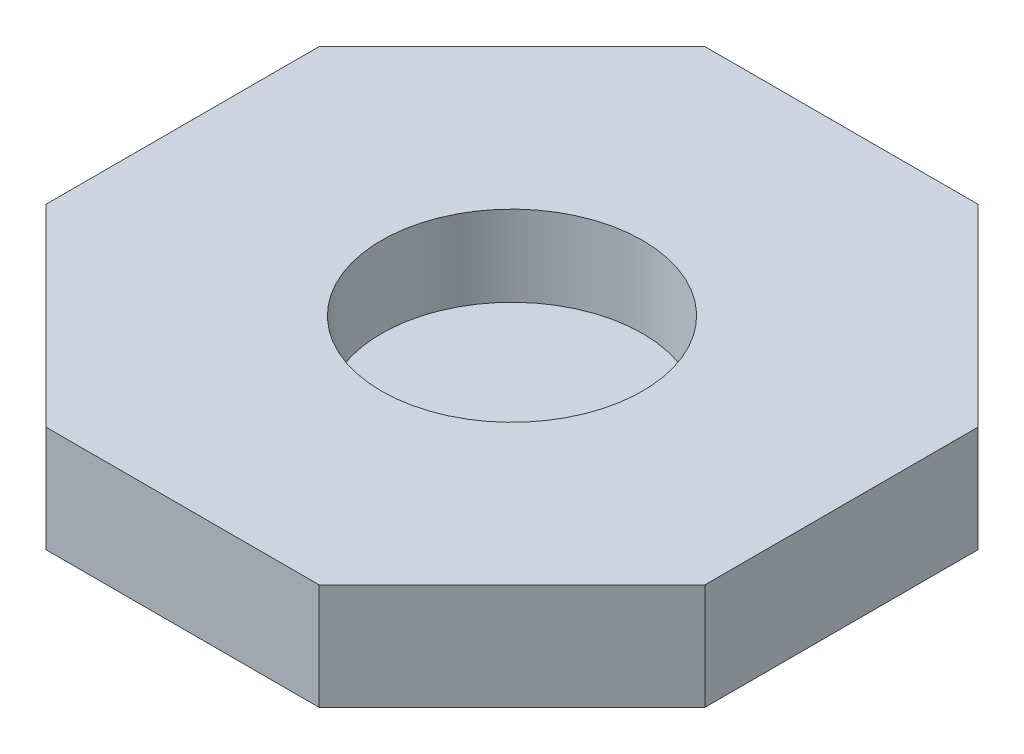
ISO-10303-21;
HEADER;
FILE_DESCRIPTION(('STEP AP214'),'2;1');
FILE_NAME('part.step','',(''),(''),'','','');
FILE_SCHEMA(('AUTOMOTIVE_DESIGN { 1 0 10303 214 1 1 1 1 }'));
ENDSEC;
DATA;
#1=APPLICATION_CONTEXT('core data for automotive mechanical design processes');
#2=APPLICATION_PROTOCOL_DEFINITION('international standard','automotive_design',2000,#1);
#3=PRODUCT_CONTEXT('',#1,'mechanical');
#4=PRODUCT('Part','Part','',(#3));
#5=PRODUCT_RELATED_PRODUCT_CATEGORY('part','',(#4));
#6=PRODUCT_DEFINITION_FORMATION('','',#4);
#7=PRODUCT_DEFINITION_CONTEXT('part definition',#1,'design');
#8=PRODUCT_DEFINITION('design','',#6,#7);
#9=PRODUCT_DEFINITION_SHAPE('','',#8);
#10=(LENGTH_UNIT() NAMED_UNIT(*) SI_UNIT(.MILLI.,.METRE.));
#11=(NAMED_UNIT(*) PLANE_ANGLE_UNIT() SI_UNIT($,.RADIAN.));
#12=(NAMED_UNIT(*) SI_UNIT($,.STERADIAN.) SOLID_ANGLE_UNIT());
#13=UNCERTAINTY_MEASURE_WITH_UNIT(LENGTH_MEASURE(1.E-05),#10,'distance_accuracy_value','');
#14=(GEOMETRIC_REPRESENTATION_CONTEXT(3) GLOBAL_UNCERTAINTY_ASSIGNED_CONTEXT((#13)) GLOBAL_UNIT_ASSIGNED_CONTEXT((#10,
#11,#12)) REPRESENTATION_CONTEXT('',''));
#15=CARTESIAN_POINT('',(0.,0.,0.));
#16=DIRECTION('',(0.,0.,1.));
#17=DIRECTION('',(1.,0.,0.));
#18=AXIS2_PLACEMENT_3D('',#15,#16,#17);
#19=CARTESIAN_POINT('',(0.,0.,0.));
#20=DIRECTION('',(0.,1.,0.));
#21=DIRECTION('',(0.,0.,1.));
#22=AXIS2_PLACEMENT_3D('',#19,#20,#21);
#23=PLANE('',#22);
#24=DIRECTION('',(1.,0.,0.));
#25=VECTOR('',#24,1.);
#26=CARTESIAN_POINT('',(-5.43453692681118,0.,-13.1201327539249));
#27=LINE('',#26,#25);
#28=CARTESIAN_POINT('',(-5.43453692681118,0.,-13.1201327539249));
#29=VERTEX_POINT('',#28);
#30=CARTESIAN_POINT('',(5.4345369268112,0.,-13.1201327539249));
#31=VERTEX_POINT('',#30);
#32=EDGE_CURVE('E251',#29,#31,#27,.T.);
#33=ORIENTED_EDGE('',*,*,#32,.T.);
#34=DIRECTION('',(0.707106781186548,0.,0.707106781186547));
#35=VECTOR('',#34,1.);
#36=CARTESIAN_POINT('',(5.4345369268112,0.,-13.1201327539249));
#37=LINE('',#36,#35);
#38=CARTESIAN_POINT('',(13.120132753925,0.,-5.43453692681118));
#39=VERTEX_POINT('',#38);
#40=EDGE_CURVE('E207',#31,#39,#37,.T.);
#41=ORIENTED_EDGE('',*,*,#40,.T.);
#42=DIRECTION('',(0.,0.,1.));
#43=VECTOR('',#42,1.);
#44=CARTESIAN_POINT('',(13.120132753925,0.,-5.43453692681118));
#45=LINE('',#44,#43);
#46=CARTESIAN_POINT('',(13.120132753925,0.,5.43453692681119));
#47=VERTEX_POINT('',#46);
#48=EDGE_CURVE('E63',#39,#47,#45,.T.);
#49=ORIENTED_EDGE('',*,*,#48,.T.);
#50=DIRECTION('',(-0.707106781186548,0.,0.707106781186547));
#51=VECTOR('',#50,1.);
#52=CARTESIAN_POINT('',(13.120132753925,0.,5.43453692681119));
#53=LINE('',#52,#51);
#54=CARTESIAN_POINT('',(5.43453692681119,0.,13.120132753925));
#55=VERTEX_POINT('',#54);
#56=EDGE_CURVE('E256',#47,#55,#53,.T.);
#57=ORIENTED_EDGE('',*,*,#56,.T.);
#58=DIRECTION('',(-1.,0.,0.));
#59=VECTOR('',#58,1.);
#60=CARTESIAN_POINT('',(5.43453692681119,0.,13.120132753925));
#61=LINE('',#60,#59);
#62=CARTESIAN_POINT('',(-5.43453692681118,0.,13.120132753925));
#63=VERTEX_POINT('',#62);
#64=EDGE_CURVE('E259',#55,#63,#61,.T.);
#65=ORIENTED_EDGE('',*,*,#64,.T.);
#66=DIRECTION('',(-0.707106781186548,0.,-0.707106781186547));
#67=VECTOR('',#66,1.);
#68=CARTESIAN_POINT('',(-5.43453692681118,0.,13.120132753925));
#69=LINE('',#68,#67);
#70=CARTESIAN_POINT('',(-13.1201327539249,0.,5.4345369268112));
#71=VERTEX_POINT('',#70);
#72=EDGE_CURVE('E262',#63,#71,#69,.T.);
#73=ORIENTED_EDGE('',*,*,#72,.T.);
#74=DIRECTION('',(0.,0.,-1.));
#75=VECTOR('',#74,1.);
#76=CARTESIAN_POINT('',(-13.1201327539249,0.,5.4345369268112));
#77=LINE('',#76,#75);
#78=CARTESIAN_POINT('',(-13.1201327539249,0.,-5.43453692681117));
#79=VERTEX_POINT('',#78);
#80=EDGE_CURVE('E231',#71,#79,#77,.T.);
#81=ORIENTED_EDGE('',*,*,#80,.T.);
#82=DIRECTION('',(0.707106781186547,0.,-0.707106781186548));
#83=VECTOR('',#82,1.);
#84=CARTESIAN_POINT('',(-13.1201327539249,0.,-5.43453692681117));
#85=LINE('',#84,#83);
#86=EDGE_CURVE('E228',#79,#29,#85,.T.);
#87=ORIENTED_EDGE('',*,*,#86,.T.);
#88=EDGE_LOOP('',(#33,#41,#49,#57,#65,#73,#81,#87));
#89=FACE_BOUND('',#88,.T.);
#90=CARTESIAN_POINT('',(0.,0.,0.));
#91=DIRECTION('',(0.,1.,0.));
#92=DIRECTION('',(0.,0.,1.));
#93=AXIS2_PLACEMENT_3D('',#90,#91,#92);
#94=CIRCLE('',#93,5.);
#95=CARTESIAN_POINT('',(0.,0.,5.));
#96=VERTEX_POINT('',#95);
#97=EDGE_CURVE('E11',#96,#96,#94,.F.);
#98=ORIENTED_EDGE('',*,*,#97,.F.);
#99=EDGE_LOOP('',(#98));
#100=FACE_BOUND('',#99,.T.);
#101=ADVANCED_FACE('F40',(#89,#100),#23,.F.);
#102=CARTESIAN_POINT('',(10.9743911152158,5.,-10.9743911152158));
#103=DIRECTION('',(-0.707106781186548,0.,0.707106781186548));
#104=DIRECTION('',(0.707106781186548,0.,0.707106781186548));
#105=AXIS2_PLACEMENT_3D('',#102,#103,#104);
#106=PLANE('',#105);
#107=DIRECTION('',(-0.707106781186548,0.,-0.707106781186548));
#108=VECTOR('',#107,1.);
#109=CARTESIAN_POINT('',(10.9743911152158,0.,-10.9743911152158));
#110=LINE('',#109,#108);
#111=CARTESIAN_POINT('',(15.520132753925,0.,-6.42864947650661));
#112=VERTEX_POINT('',#111);
#113=CARTESIAN_POINT('',(6.42864947650663,0.,-15.5201327539249));
#114=VERTEX_POINT('',#113);
#115=EDGE_CURVE('E328',#112,#114,#110,.T.);
#116=ORIENTED_EDGE('',*,*,#115,.T.);
#117=DIRECTION('',(0.,-1.,0.));
#118=VECTOR('',#117,1.);
#119=CARTESIAN_POINT('',(6.42864947650663,5.,-15.5201327539249));
#120=LINE('',#119,#118);
#121=CARTESIAN_POINT('',(6.42864947650663,5.,-15.5201327539249));
#122=VERTEX_POINT('',#121);
#123=EDGE_CURVE('E48',#122,#114,#120,.T.);
#124=ORIENTED_EDGE('',*,*,#123,.F.);
#125=DIRECTION('',(-0.707106781186548,0.,-0.707106781186548));
#126=VECTOR('',#125,1.);
#127=CARTESIAN_POINT('',(10.9743911152158,5.,-10.9743911152158));
#128=LINE('',#127,#126);
#129=CARTESIAN_POINT('',(15.520132753925,5.,-6.42864947650661));
#130=VERTEX_POINT('',#129);
#131=EDGE_CURVE('E342',#130,#122,#128,.T.);
#132=ORIENTED_EDGE('',*,*,#131,.F.);
#133=DIRECTION('',(0.,-1.,0.));
#134=VECTOR('',#133,1.);
#135=CARTESIAN_POINT('',(15.520132753925,5.,-6.42864947650661));
#136=LINE('',#135,#134);
#137=EDGE_CURVE('E360',#130,#112,#136,.T.);
#138=ORIENTED_EDGE('',*,*,#137,.T.);
#139=EDGE_LOOP('',(#116,#124,#132,#138));
#140=FACE_BOUND('',#139,.T.);
#141=ADVANCED_FACE('F42',(#140),#106,.F.);
#142=CARTESIAN_POINT('',(0.,5.,-15.5201327539249));
#143=DIRECTION('',(0.,0.,1.));
#144=DIRECTION('',(1.,0.,0.));
#145=AXIS2_PLACEMENT_3D('',#142,#143,#144);
#146=PLANE('',#145);
#147=DIRECTION('',(-1.,0.,0.));
#148=VECTOR('',#147,1.);
#149=CARTESIAN_POINT('',(0.,0.,-15.5201327539249));
#150=LINE('',#149,#148);
#151=CARTESIAN_POINT('',(-6.42864947650661,0.,-15.5201327539249));
#152=VERTEX_POINT('',#151);
#153=EDGE_CURVE('E363',#114,#152,#150,.T.);
#154=ORIENTED_EDGE('',*,*,#153,.T.);
#155=DIRECTION('',(0.,-1.,0.));
#156=VECTOR('',#155,1.);
#157=CARTESIAN_POINT('',(-6.42864947650661,5.,-15.5201327539249));
#158=LINE('',#157,#156);
#159=CARTESIAN_POINT('',(-6.42864947650661,5.,-15.5201327539249));
#160=VERTEX_POINT('',#159);
#161=EDGE_CURVE('E393',#160,#152,#158,.T.);
#162=ORIENTED_EDGE('',*,*,#161,.F.);
#163=DIRECTION('',(-1.,0.,0.));
#164=VECTOR('',#163,1.);
#165=CARTESIAN_POINT('',(0.,5.,-15.5201327539249));
#166=LINE('',#165,#164);
#167=EDGE_CURVE('E345',#122,#160,#166,.T.);
#168=ORIENTED_EDGE('',*,*,#167,.F.);
#169=ORIENTED_EDGE('',*,*,#123,.T.);
#170=EDGE_LOOP('',(#154,#162,#168,#169));
#171=FACE_BOUND('',#170,.T.);
#172=ADVANCED_FACE('F398',(#171),#146,.F.);
#173=CARTESIAN_POINT('',(-10.9743911152158,5.,-10.9743911152158));
#174=DIRECTION('',(0.707106781186548,0.,0.707106781186547));
#175=DIRECTION('',(0.707106781186547,0.,-0.707106781186548));
#176=AXIS2_PLACEMENT_3D('',#173,#174,#175);
#177=PLANE('',#176);
#178=DIRECTION('',(-0.707106781186547,0.,0.707106781186548));
#179=VECTOR('',#178,1.);
#180=CARTESIAN_POINT('',(-10.9743911152158,0.,-10.9743911152158));
#181=LINE('',#180,#179);
#182=CARTESIAN_POINT('',(-15.5201327539249,0.,-6.4286494765066));
#183=VERTEX_POINT('',#182);
#184=EDGE_CURVE('E365',#152,#183,#181,.T.);
#185=ORIENTED_EDGE('',*,*,#184,.T.);
#186=DIRECTION('',(0.,-1.,0.));
#187=VECTOR('',#186,1.);
#188=CARTESIAN_POINT('',(-15.5201327539249,5.,-6.4286494765066));
#189=LINE('',#188,#187);
#190=CARTESIAN_POINT('',(-15.5201327539249,5.,-6.4286494765066));
#191=VERTEX_POINT('',#190);
#192=EDGE_CURVE('E390',#191,#183,#189,.T.);
#193=ORIENTED_EDGE('',*,*,#192,.F.);
#194=DIRECTION('',(-0.707106781186547,0.,0.707106781186548));
#195=VECTOR('',#194,1.);
#196=CARTESIAN_POINT('',(-10.9743911152158,5.,-10.9743911152158));
#197=LINE('',#196,#195);
#198=EDGE_CURVE('E348',#160,#191,#197,.T.);
#199=ORIENTED_EDGE('',*,*,#198,.F.);
#200=ORIENTED_EDGE('',*,*,#161,.T.);
#201=EDGE_LOOP('',(#185,#193,#199,#200));
#202=FACE_BOUND('',#201,.T.);
#203=ADVANCED_FACE('F413',(#202),#177,.F.);
#204=CARTESIAN_POINT('',(-15.5201327539249,5.,0.));
#205=DIRECTION('',(1.,0.,0.));
#206=DIRECTION('',(0.,0.,-1.));
#207=AXIS2_PLACEMENT_3D('',#204,#205,#206);
#208=PLANE('',#207);
#209=DIRECTION('',(0.,0.,1.));
#210=VECTOR('',#209,1.);
#211=CARTESIAN_POINT('',(-15.5201327539249,0.,0.));
#212=LINE('',#211,#210);
#213=CARTESIAN_POINT('',(-15.5201327539249,0.,6.42864947650662));
#214=VERTEX_POINT('',#213);
#215=EDGE_CURVE('E367',#183,#214,#212,.T.);
#216=ORIENTED_EDGE('',*,*,#215,.T.);
#217=DIRECTION('',(0.,-1.,0.));
#218=VECTOR('',#217,1.);
#219=CARTESIAN_POINT('',(-15.5201327539249,5.,6.42864947650662));
#220=LINE('',#219,#218);
#221=CARTESIAN_POINT('',(-15.5201327539249,5.,6.42864947650662));
#222=VERTEX_POINT('',#221);
#223=EDGE_CURVE('E387',#222,#214,#220,.T.);
#224=ORIENTED_EDGE('',*,*,#223,.F.);
#225=DIRECTION('',(0.,0.,1.));
#226=VECTOR('',#225,1.);
#227=CARTESIAN_POINT('',(-15.5201327539249,5.,0.));
#228=LINE('',#227,#226);
#229=EDGE_CURVE('E350',#191,#222,#228,.T.);
#230=ORIENTED_EDGE('',*,*,#229,.F.);
#231=ORIENTED_EDGE('',*,*,#192,.T.);
#232=EDGE_LOOP('',(#216,#224,#230,#231));
#233=FACE_BOUND('',#232,.T.);
#234=ADVANCED_FACE('F417',(#233),#208,.F.);
#235=CARTESIAN_POINT('',(-10.9743911152158,5.,10.9743911152158));
#236=DIRECTION('',(0.707106781186548,0.,-0.707106781186548));
#237=DIRECTION('',(-0.707106781186548,0.,-0.707106781186548));
#238=AXIS2_PLACEMENT_3D('',#235,#236,#237);
#239=PLANE('',#238);
#240=DIRECTION('',(0.707106781186548,0.,0.707106781186548));
#241=VECTOR('',#240,1.);
#242=CARTESIAN_POINT('',(-10.9743911152158,0.,10.9743911152158));
#243=LINE('',#242,#241);
#244=CARTESIAN_POINT('',(-6.42864947650661,0.,15.520132753925));
#245=VERTEX_POINT('',#244);
#246=EDGE_CURVE('E369',#214,#245,#243,.T.);
#247=ORIENTED_EDGE('',*,*,#246,.T.);
#248=DIRECTION('',(0.,-1.,0.));
#249=VECTOR('',#248,1.);
#250=CARTESIAN_POINT('',(-6.42864947650661,5.,15.520132753925));
#251=LINE('',#250,#249);
#252=CARTESIAN_POINT('',(-6.42864947650661,5.,15.520132753925));
#253=VERTEX_POINT('',#252);
#254=EDGE_CURVE('E384',#253,#245,#251,.T.);
#255=ORIENTED_EDGE('',*,*,#254,.F.);
#256=DIRECTION('',(0.707106781186548,0.,0.707106781186548));
#257=VECTOR('',#256,1.);
#258=CARTESIAN_POINT('',(-10.9743911152158,5.,10.9743911152158));
#259=LINE('',#258,#257);
#260=EDGE_CURVE('E352',#222,#253,#259,.T.);
#261=ORIENTED_EDGE('',*,*,#260,.F.);
#262=ORIENTED_EDGE('',*,*,#223,.T.);
#263=EDGE_LOOP('',(#247,#255,#261,#262));
#264=FACE_BOUND('',#263,.T.);
#265=ADVANCED_FACE('F436',(#264),#239,.F.);
#266=CARTESIAN_POINT('',(0.,5.,15.520132753925));
#267=DIRECTION('',(0.,0.,-1.));
#268=DIRECTION('',(-1.,0.,0.));
#269=AXIS2_PLACEMENT_3D('',#266,#267,#268);
#270=PLANE('',#269);
#271=DIRECTION('',(1.,0.,0.));
#272=VECTOR('',#271,1.);
#273=CARTESIAN_POINT('',(0.,0.,15.520132753925));
#274=LINE('',#273,#272);
#275=CARTESIAN_POINT('',(6.42864947650662,0.,15.520132753925));
#276=VERTEX_POINT('',#275);
#277=EDGE_CURVE('E371',#245,#276,#274,.T.);
#278=ORIENTED_EDGE('',*,*,#277,.T.);
#279=DIRECTION('',(0.,-1.,0.));
#280=VECTOR('',#279,1.);
#281=CARTESIAN_POINT('',(6.42864947650662,5.,15.520132753925));
#282=LINE('',#281,#280);
#283=CARTESIAN_POINT('',(6.42864947650662,5.,15.520132753925));
#284=VERTEX_POINT('',#283);
#285=EDGE_CURVE('E381',#284,#276,#282,.T.);
#286=ORIENTED_EDGE('',*,*,#285,.F.);
#287=DIRECTION('',(1.,0.,0.));
#288=VECTOR('',#287,1.);
#289=CARTESIAN_POINT('',(0.,5.,15.520132753925));
#290=LINE('',#289,#288);
#291=EDGE_CURVE('E354',#253,#284,#290,.T.);
#292=ORIENTED_EDGE('',*,*,#291,.F.);
#293=ORIENTED_EDGE('',*,*,#254,.T.);
#294=EDGE_LOOP('',(#278,#286,#292,#293));
#295=FACE_BOUND('',#294,.T.);
#296=ADVANCED_FACE('F433',(#295),#270,.F.);
#297=CARTESIAN_POINT('',(10.9743911152158,5.,10.9743911152158));
#298=DIRECTION('',(-0.707106781186547,0.,-0.707106781186548));
#299=DIRECTION('',(-0.707106781186548,0.,0.707106781186547));
#300=AXIS2_PLACEMENT_3D('',#297,#298,#299);
#301=PLANE('',#300);
#302=DIRECTION('',(0.707106781186548,0.,-0.707106781186547));
#303=VECTOR('',#302,1.);
#304=CARTESIAN_POINT('',(10.9743911152158,0.,10.9743911152158));
#305=LINE('',#304,#303);
#306=CARTESIAN_POINT('',(15.520132753925,0.,6.42864947650662));
#307=VERTEX_POINT('',#306);
#308=EDGE_CURVE('E373',#276,#307,#305,.T.);
#309=ORIENTED_EDGE('',*,*,#308,.T.);
#310=DIRECTION('',(0.,-1.,0.));
#311=VECTOR('',#310,1.);
#312=CARTESIAN_POINT('',(15.520132753925,5.,6.42864947650662));
#313=LINE('',#312,#311);
#314=CARTESIAN_POINT('',(15.520132753925,5.,6.42864947650662));
#315=VERTEX_POINT('',#314);
#316=EDGE_CURVE('E378',#315,#307,#313,.T.);
#317=ORIENTED_EDGE('',*,*,#316,.F.);
#318=DIRECTION('',(0.707106781186548,0.,-0.707106781186547));
#319=VECTOR('',#318,1.);
#320=CARTESIAN_POINT('',(10.9743911152158,5.,10.9743911152158));
#321=LINE('',#320,#319);
#322=EDGE_CURVE('E356',#284,#315,#321,.T.);
#323=ORIENTED_EDGE('',*,*,#322,.F.);
#324=ORIENTED_EDGE('',*,*,#285,.T.);
#325=EDGE_LOOP('',(#309,#317,#323,#324));
#326=FACE_BOUND('',#325,.T.);
#327=ADVANCED_FACE('F429',(#326),#301,.F.);
#328=CARTESIAN_POINT('',(15.520132753925,5.,0.));
#329=DIRECTION('',(-1.,0.,0.));
#330=DIRECTION('',(0.,0.,1.));
#331=AXIS2_PLACEMENT_3D('',#328,#329,#330);
#332=PLANE('',#331);
#333=DIRECTION('',(0.,0.,-1.));
#334=VECTOR('',#333,1.);
#335=CARTESIAN_POINT('',(15.520132753925,0.,0.));
#336=LINE('',#335,#334);
#337=EDGE_CURVE('E346',#307,#112,#336,.T.);
#338=ORIENTED_EDGE('',*,*,#337,.T.);
#339=ORIENTED_EDGE('',*,*,#137,.F.);
#340=DIRECTION('',(0.,0.,-1.));
#341=VECTOR('',#340,1.);
#342=CARTESIAN_POINT('',(15.520132753925,5.,0.));
#343=LINE('',#342,#341);
#344=EDGE_CURVE('E358',#315,#130,#343,.T.);
#345=ORIENTED_EDGE('',*,*,#344,.F.);
#346=ORIENTED_EDGE('',*,*,#316,.T.);
#347=EDGE_LOOP('',(#338,#339,#345,#346));
#348=FACE_BOUND('',#347,.T.);
#349=ADVANCED_FACE('F427',(#348),#332,.F.);
#350=CARTESIAN_POINT('',(0.,5.,0.));
#351=DIRECTION('',(0.,1.,0.));
#352=DIRECTION('',(0.,0.,1.));
#353=AXIS2_PLACEMENT_3D('',#350,#351,#352);
#354=PLANE('',#353);
#355=CARTESIAN_POINT('',(0.,5.,0.));
#356=DIRECTION('',(0.,1.,0.));
#357=DIRECTION('',(0.,0.,1.));
#358=AXIS2_PLACEMENT_3D('',#355,#356,#357);
#359=CIRCLE('',#358,6.15);
#360=CARTESIAN_POINT('',(0.,5.,6.15));
#361=VERTEX_POINT('',#360);
#362=EDGE_CURVE('E234',#361,#361,#359,.T.);
#363=ORIENTED_EDGE('',*,*,#362,.F.);
#364=EDGE_LOOP('',(#363));
#365=FACE_BOUND('',#364,.T.);
#366=ORIENTED_EDGE('',*,*,#131,.T.);
#367=ORIENTED_EDGE('',*,*,#167,.T.);
#368=ORIENTED_EDGE('',*,*,#198,.T.);
#369=ORIENTED_EDGE('',*,*,#229,.T.);
#370=ORIENTED_EDGE('',*,*,#260,.T.);
#371=ORIENTED_EDGE('',*,*,#291,.T.);
#372=ORIENTED_EDGE('',*,*,#322,.T.);
#373=ORIENTED_EDGE('',*,*,#344,.T.);
#374=EDGE_LOOP('',(#366,#367,#368,#369,#370,#371,#372,#373));
#375=FACE_BOUND('',#374,.T.);
#376=ADVANCED_FACE('F421',(#365,#375),#354,.T.);
#377=DIRECTION('',(0.707106781186547,0.,0.707106781186547));
#378=VECTOR('',#377,1.);
#379=CARTESIAN_POINT('',(5.93159320165891,0.,-14.3201327539249));
#380=LINE('',#379,#378);
#381=CARTESIAN_POINT('',(5.93159320165891,0.,-14.3201327539249));
#382=VERTEX_POINT('',#381);
#383=CARTESIAN_POINT('',(14.320132753925,0.,-5.9315932016589));
#384=VERTEX_POINT('',#383);
#385=EDGE_CURVE('E306',#382,#384,#380,.T.);
#386=ORIENTED_EDGE('',*,*,#385,.F.);
#387=DIRECTION('',(1.,0.,0.));
#388=VECTOR('',#387,1.);
#389=CARTESIAN_POINT('',(-5.93159320165889,0.,-14.3201327539249));
#390=LINE('',#389,#388);
#391=CARTESIAN_POINT('',(-5.93159320165889,0.,-14.3201327539249));
#392=VERTEX_POINT('',#391);
#393=EDGE_CURVE('E55',#392,#382,#390,.T.);
#394=ORIENTED_EDGE('',*,*,#393,.F.);
#395=DIRECTION('',(0.707106781186547,0.,-0.707106781186547));
#396=VECTOR('',#395,1.);
#397=CARTESIAN_POINT('',(-14.3201327539249,0.,-5.93159320165888));
#398=LINE('',#397,#396);
#399=CARTESIAN_POINT('',(-14.3201327539249,0.,-5.93159320165888));
#400=VERTEX_POINT('',#399);
#401=EDGE_CURVE('E283',#400,#392,#398,.T.);
#402=ORIENTED_EDGE('',*,*,#401,.F.);
#403=DIRECTION('',(0.,0.,-1.));
#404=VECTOR('',#403,1.);
#405=CARTESIAN_POINT('',(-14.3201327539249,0.,5.93159320165891));
#406=LINE('',#405,#404);
#407=CARTESIAN_POINT('',(-14.3201327539249,0.,5.93159320165891));
#408=VERTEX_POINT('',#407);
#409=EDGE_CURVE('E321',#408,#400,#406,.T.);
#410=ORIENTED_EDGE('',*,*,#409,.F.);
#411=DIRECTION('',(-0.707106781186548,0.,-0.707106781186548));
#412=VECTOR('',#411,1.);
#413=CARTESIAN_POINT('',(-5.9315932016589,0.,14.320132753925));
#414=LINE('',#413,#412);
#415=CARTESIAN_POINT('',(-5.9315932016589,0.,14.320132753925));
#416=VERTEX_POINT('',#415);
#417=EDGE_CURVE('E318',#416,#408,#414,.T.);
#418=ORIENTED_EDGE('',*,*,#417,.F.);
#419=DIRECTION('',(-1.,0.,0.));
#420=VECTOR('',#419,1.);
#421=CARTESIAN_POINT('',(5.9315932016589,0.,14.320132753925));
#422=LINE('',#421,#420);
#423=CARTESIAN_POINT('',(5.9315932016589,0.,14.320132753925));
#424=VERTEX_POINT('',#423);
#425=EDGE_CURVE('E315',#424,#416,#422,.T.);
#426=ORIENTED_EDGE('',*,*,#425,.F.);
#427=DIRECTION('',(-0.707106781186548,0.,0.707106781186547));
#428=VECTOR('',#427,1.);
#429=CARTESIAN_POINT('',(14.320132753925,0.,5.9315932016589));
#430=LINE('',#429,#428);
#431=CARTESIAN_POINT('',(14.320132753925,0.,5.9315932016589));
#432=VERTEX_POINT('',#431);
#433=EDGE_CURVE('E312',#432,#424,#430,.T.);
#434=ORIENTED_EDGE('',*,*,#433,.F.);
#435=DIRECTION('',(0.,0.,1.));
#436=VECTOR('',#435,1.);
#437=CARTESIAN_POINT('',(14.320132753925,0.,-5.9315932016589));
#438=LINE('',#437,#436);
#439=EDGE_CURVE('E309',#384,#432,#438,.T.);
#440=ORIENTED_EDGE('',*,*,#439,.F.);
#441=EDGE_LOOP('',(#386,#394,#402,#410,#418,#426,#434,#440));
#442=FACE_BOUND('',#441,.T.);
#443=ORIENTED_EDGE('',*,*,#115,.F.);
#444=ORIENTED_EDGE('',*,*,#337,.F.);
#445=ORIENTED_EDGE('',*,*,#308,.F.);
#446=ORIENTED_EDGE('',*,*,#277,.F.);
#447=ORIENTED_EDGE('',*,*,#246,.F.);
#448=ORIENTED_EDGE('',*,*,#215,.F.);
#449=ORIENTED_EDGE('',*,*,#184,.F.);
#450=ORIENTED_EDGE('',*,*,#153,.F.);
#451=EDGE_LOOP('',(#443,#444,#445,#446,#447,#448,#449,#450));
#452=FACE_BOUND('',#451,.T.);
#453=ADVANCED_FACE('F406',(#442,#452),#23,.F.);
#454=CARTESIAN_POINT('',(-5.93159320165889,1.,-14.3201327539249));
#455=DIRECTION('',(0.,0.,-1.));
#456=DIRECTION('',(-1.,0.,0.));
#457=AXIS2_PLACEMENT_3D('',#454,#455,#456);
#458=PLANE('',#457);
#459=ORIENTED_EDGE('',*,*,#393,.T.);
#460=DIRECTION('',(0.,-1.,0.));
#461=VECTOR('',#460,1.);
#462=CARTESIAN_POINT('',(5.93159320165891,1.,-14.3201327539249));
#463=LINE('',#462,#461);
#464=CARTESIAN_POINT('',(5.93159320165891,1.,-14.3201327539249));
#465=VERTEX_POINT('',#464);
#466=EDGE_CURVE('E304',#465,#382,#463,.T.);
#467=ORIENTED_EDGE('',*,*,#466,.F.);
#468=DIRECTION('',(1.,0.,0.));
#469=VECTOR('',#468,1.);
#470=CARTESIAN_POINT('',(-5.93159320165889,1.,-14.3201327539249));
#471=LINE('',#470,#469);
#472=CARTESIAN_POINT('',(-5.93159320165889,1.,-14.3201327539249));
#473=VERTEX_POINT('',#472);
#474=EDGE_CURVE('E279',#473,#465,#471,.T.);
#475=ORIENTED_EDGE('',*,*,#474,.F.);
#476=DIRECTION('',(0.,-1.,0.));
#477=VECTOR('',#476,1.);
#478=CARTESIAN_POINT('',(-5.93159320165889,1.,-14.3201327539249));
#479=LINE('',#478,#477);
#480=EDGE_CURVE('E326',#473,#392,#479,.T.);
#481=ORIENTED_EDGE('',*,*,#480,.T.);
#482=EDGE_LOOP('',(#459,#467,#475,#481));
#483=FACE_BOUND('',#482,.T.);
#484=ADVANCED_FACE('F460',(#483),#458,.F.);
#485=CARTESIAN_POINT('',(-14.3201327539249,1.,-5.93159320165888));
#486=DIRECTION('',(-0.707106781186548,0.,-0.707106781186548));
#487=DIRECTION('',(-0.707106781186547,0.,0.707106781186548));
#488=AXIS2_PLACEMENT_3D('',#485,#486,#487);
#489=PLANE('',#488);
#490=ORIENTED_EDGE('',*,*,#401,.T.);
#491=ORIENTED_EDGE('',*,*,#480,.F.);
#492=DIRECTION('',(0.707106781186547,0.,-0.707106781186547));
#493=VECTOR('',#492,1.);
#494=CARTESIAN_POINT('',(-14.3201327539249,1.,-5.93159320165888));
#495=LINE('',#494,#493);
#496=CARTESIAN_POINT('',(-14.3201327539249,1.,-5.93159320165888));
#497=VERTEX_POINT('',#496);
#498=EDGE_CURVE('E301',#497,#473,#495,.T.);
#499=ORIENTED_EDGE('',*,*,#498,.F.);
#500=DIRECTION('',(0.,-1.,0.));
#501=VECTOR('',#500,1.);
#502=CARTESIAN_POINT('',(-14.3201327539249,1.,-5.93159320165888));
#503=LINE('',#502,#501);
#504=EDGE_CURVE('E329',#497,#400,#503,.T.);
#505=ORIENTED_EDGE('',*,*,#504,.T.);
#506=EDGE_LOOP('',(#490,#491,#499,#505));
#507=FACE_BOUND('',#506,.T.);
#508=ADVANCED_FACE('F466',(#507),#489,.F.);
#509=CARTESIAN_POINT('',(-14.3201327539249,1.,5.93159320165891));
#510=DIRECTION('',(-1.,0.,0.));
#511=DIRECTION('',(0.,0.,1.));
#512=AXIS2_PLACEMENT_3D('',#509,#510,#511);
#513=PLANE('',#512);
#514=ORIENTED_EDGE('',*,*,#409,.T.);
#515=ORIENTED_EDGE('',*,*,#504,.F.);
#516=DIRECTION('',(0.,0.,-1.));
#517=VECTOR('',#516,1.);
#518=CARTESIAN_POINT('',(-14.3201327539249,1.,5.93159320165891));
#519=LINE('',#518,#517);
#520=CARTESIAN_POINT('',(-14.3201327539249,1.,5.93159320165891));
#521=VERTEX_POINT('',#520);
#522=EDGE_CURVE('E298',#521,#497,#519,.T.);
#523=ORIENTED_EDGE('',*,*,#522,.F.);
#524=DIRECTION('',(0.,-1.,0.));
#525=VECTOR('',#524,1.);
#526=CARTESIAN_POINT('',(-14.3201327539249,1.,5.93159320165891));
#527=LINE('',#526,#525);
#528=EDGE_CURVE('E331',#521,#408,#527,.T.);
#529=ORIENTED_EDGE('',*,*,#528,.T.);
#530=EDGE_LOOP('',(#514,#515,#523,#529));
#531=FACE_BOUND('',#530,.T.);
#532=ADVANCED_FACE('F485',(#531),#513,.F.);
#533=CARTESIAN_POINT('',(-5.9315932016589,1.,14.320132753925));
#534=DIRECTION('',(-0.707106781186547,0.,0.707106781186548));
#535=DIRECTION('',(0.707106781186548,0.,0.707106781186547));
#536=AXIS2_PLACEMENT_3D('',#533,#534,#535);
#537=PLANE('',#536);
#538=ORIENTED_EDGE('',*,*,#417,.T.);
#539=ORIENTED_EDGE('',*,*,#528,.F.);
#540=DIRECTION('',(-0.707106781186548,0.,-0.707106781186548));
#541=VECTOR('',#540,1.);
#542=CARTESIAN_POINT('',(-5.9315932016589,1.,14.320132753925));
#543=LINE('',#542,#541);
#544=CARTESIAN_POINT('',(-5.9315932016589,1.,14.320132753925));
#545=VERTEX_POINT('',#544);
#546=EDGE_CURVE('E295',#545,#521,#543,.T.);
#547=ORIENTED_EDGE('',*,*,#546,.F.);
#548=DIRECTION('',(0.,-1.,0.));
#549=VECTOR('',#548,1.);
#550=CARTESIAN_POINT('',(-5.9315932016589,1.,14.320132753925));
#551=LINE('',#550,#549);
#552=EDGE_CURVE('E333',#545,#416,#551,.T.);
#553=ORIENTED_EDGE('',*,*,#552,.T.);
#554=EDGE_LOOP('',(#538,#539,#547,#553));
#555=FACE_BOUND('',#554,.T.);
#556=ADVANCED_FACE('F488',(#555),#537,.F.);
#557=CARTESIAN_POINT('',(5.9315932016589,1.,14.320132753925));
#558=DIRECTION('',(0.,0.,1.));
#559=DIRECTION('',(1.,0.,0.));
#560=AXIS2_PLACEMENT_3D('',#557,#558,#559);
#561=PLANE('',#560);
#562=ORIENTED_EDGE('',*,*,#425,.T.);
#563=ORIENTED_EDGE('',*,*,#552,.F.);
#564=DIRECTION('',(-1.,0.,0.));
#565=VECTOR('',#564,1.);
#566=CARTESIAN_POINT('',(5.9315932016589,1.,14.320132753925));
#567=LINE('',#566,#565);
#568=CARTESIAN_POINT('',(5.9315932016589,1.,14.320132753925));
#569=VERTEX_POINT('',#568);
#570=EDGE_CURVE('E292',#569,#545,#567,.T.);
#571=ORIENTED_EDGE('',*,*,#570,.F.);
#572=DIRECTION('',(0.,-1.,0.));
#573=VECTOR('',#572,1.);
#574=CARTESIAN_POINT('',(5.9315932016589,1.,14.320132753925));
#575=LINE('',#574,#573);
#576=EDGE_CURVE('E335',#569,#424,#575,.T.);
#577=ORIENTED_EDGE('',*,*,#576,.T.);
#578=EDGE_LOOP('',(#562,#563,#571,#577));
#579=FACE_BOUND('',#578,.T.);
#580=ADVANCED_FACE('F491',(#579),#561,.F.);
#581=CARTESIAN_POINT('',(14.320132753925,1.,5.9315932016589));
#582=DIRECTION('',(0.707106781186547,0.,0.707106781186548));
#583=DIRECTION('',(0.707106781186548,0.,-0.707106781186547));
#584=AXIS2_PLACEMENT_3D('',#581,#582,#583);
#585=PLANE('',#584);
#586=ORIENTED_EDGE('',*,*,#433,.T.);
#587=ORIENTED_EDGE('',*,*,#576,.F.);
#588=DIRECTION('',(-0.707106781186548,0.,0.707106781186547));
#589=VECTOR('',#588,1.);
#590=CARTESIAN_POINT('',(14.320132753925,1.,5.9315932016589));
#591=LINE('',#590,#589);
#592=CARTESIAN_POINT('',(14.320132753925,1.,5.9315932016589));
#593=VERTEX_POINT('',#592);
#594=EDGE_CURVE('E289',#593,#569,#591,.T.);
#595=ORIENTED_EDGE('',*,*,#594,.F.);
#596=DIRECTION('',(0.,-1.,0.));
#597=VECTOR('',#596,1.);
#598=CARTESIAN_POINT('',(14.320132753925,1.,5.9315932016589));
#599=LINE('',#598,#597);
#600=EDGE_CURVE('E337',#593,#432,#599,.T.);
#601=ORIENTED_EDGE('',*,*,#600,.T.);
#602=EDGE_LOOP('',(#586,#587,#595,#601));
#603=FACE_BOUND('',#602,.T.);
#604=ADVANCED_FACE('F493',(#603),#585,.F.);
#605=CARTESIAN_POINT('',(14.320132753925,1.,-5.9315932016589));
#606=DIRECTION('',(1.,0.,0.));
#607=DIRECTION('',(0.,0.,-1.));
#608=AXIS2_PLACEMENT_3D('',#605,#606,#607);
#609=PLANE('',#608);
#610=ORIENTED_EDGE('',*,*,#439,.T.);
#611=ORIENTED_EDGE('',*,*,#600,.F.);
#612=DIRECTION('',(0.,0.,1.));
#613=VECTOR('',#612,1.);
#614=CARTESIAN_POINT('',(14.320132753925,1.,-5.9315932016589));
#615=LINE('',#614,#613);
#616=CARTESIAN_POINT('',(14.320132753925,1.,-5.9315932016589));
#617=VERTEX_POINT('',#616);
#618=EDGE_CURVE('E286',#617,#593,#615,.T.);
#619=ORIENTED_EDGE('',*,*,#618,.F.);
#620=DIRECTION('',(0.,-1.,0.));
#621=VECTOR('',#620,1.);
#622=CARTESIAN_POINT('',(14.320132753925,1.,-5.9315932016589));
#623=LINE('',#622,#621);
#624=EDGE_CURVE('E339',#617,#384,#623,.T.);
#625=ORIENTED_EDGE('',*,*,#624,.T.);
#626=EDGE_LOOP('',(#610,#611,#619,#625));
#627=FACE_BOUND('',#626,.T.);
#628=ADVANCED_FACE('F496',(#627),#609,.F.);
#629=CARTESIAN_POINT('',(5.93159320165891,1.,-14.3201327539249));
#630=DIRECTION('',(0.707106781186548,0.,-0.707106781186548));
#631=DIRECTION('',(-0.707106781186548,0.,-0.707106781186547));
#632=AXIS2_PLACEMENT_3D('',#629,#630,#631);
#633=PLANE('',#632);
#634=ORIENTED_EDGE('',*,*,#385,.T.);
#635=ORIENTED_EDGE('',*,*,#624,.F.);
#636=DIRECTION('',(0.707106781186547,0.,0.707106781186547));
#637=VECTOR('',#636,1.);
#638=CARTESIAN_POINT('',(5.93159320165891,1.,-14.3201327539249));
#639=LINE('',#638,#637);
#640=EDGE_CURVE('E282',#465,#617,#639,.T.);
#641=ORIENTED_EDGE('',*,*,#640,.F.);
#642=ORIENTED_EDGE('',*,*,#466,.T.);
#643=EDGE_LOOP('',(#634,#635,#641,#642));
#644=FACE_BOUND('',#643,.T.);
#645=ADVANCED_FACE('F474',(#644),#633,.F.);
#646=CARTESIAN_POINT('',(0.,1.,0.));
#647=DIRECTION('',(0.,-1.,0.));
#648=DIRECTION('',(0.,0.,-1.));
#649=AXIS2_PLACEMENT_3D('',#646,#647,#648);
#650=PLANE('',#649);
#651=DIRECTION('',(0.707106781186547,0.,-0.707106781186548));
#652=VECTOR('',#651,1.);
#653=CARTESIAN_POINT('',(-13.1201327539249,1.,-5.43453692681117));
#654=LINE('',#653,#652);
#655=CARTESIAN_POINT('',(-13.1201327539249,1.,-5.43453692681117));
#656=VERTEX_POINT('',#655);
#657=CARTESIAN_POINT('',(-5.43453692681118,1.,-13.1201327539249));
#658=VERTEX_POINT('',#657);
#659=EDGE_CURVE('E213',#656,#658,#654,.T.);
#660=ORIENTED_EDGE('',*,*,#659,.F.);
#661=DIRECTION('',(0.,0.,-1.));
#662=VECTOR('',#661,1.);
#663=CARTESIAN_POINT('',(-13.1201327539249,1.,5.4345369268112));
#664=LINE('',#663,#662);
#665=CARTESIAN_POINT('',(-13.1201327539249,1.,5.4345369268112));
#666=VERTEX_POINT('',#665);
#667=EDGE_CURVE('E247',#666,#656,#664,.T.);
#668=ORIENTED_EDGE('',*,*,#667,.F.);
#669=DIRECTION('',(-0.707106781186548,0.,-0.707106781186547));
#670=VECTOR('',#669,1.);
#671=CARTESIAN_POINT('',(-5.43453692681118,1.,13.120132753925));
#672=LINE('',#671,#670);
#673=CARTESIAN_POINT('',(-5.43453692681118,1.,13.120132753925));
#674=VERTEX_POINT('',#673);
#675=EDGE_CURVE('E244',#674,#666,#672,.T.);
#676=ORIENTED_EDGE('',*,*,#675,.F.);
#677=DIRECTION('',(-1.,0.,0.));
#678=VECTOR('',#677,1.);
#679=CARTESIAN_POINT('',(5.43453692681119,1.,13.120132753925));
#680=LINE('',#679,#678);
#681=CARTESIAN_POINT('',(5.43453692681119,1.,13.120132753925));
#682=VERTEX_POINT('',#681);
#683=EDGE_CURVE('E241',#682,#674,#680,.T.);
#684=ORIENTED_EDGE('',*,*,#683,.F.);
#685=DIRECTION('',(-0.707106781186548,0.,0.707106781186547));
#686=VECTOR('',#685,1.);
#687=CARTESIAN_POINT('',(13.120132753925,1.,5.43453692681119));
#688=LINE('',#687,#686);
#689=CARTESIAN_POINT('',(13.120132753925,1.,5.43453692681119));
#690=VERTEX_POINT('',#689);
#691=EDGE_CURVE('E238',#690,#682,#688,.T.);
#692=ORIENTED_EDGE('',*,*,#691,.F.);
#693=DIRECTION('',(0.,0.,1.));
#694=VECTOR('',#693,1.);
#695=CARTESIAN_POINT('',(13.120132753925,1.,-5.43453692681118));
#696=LINE('',#695,#694);
#697=CARTESIAN_POINT('',(13.120132753925,1.,-5.43453692681118));
#698=VERTEX_POINT('',#697);
#699=EDGE_CURVE('E224',#698,#690,#696,.T.);
#700=ORIENTED_EDGE('',*,*,#699,.F.);
#701=DIRECTION('',(0.707106781186548,0.,0.707106781186547));
#702=VECTOR('',#701,1.);
#703=CARTESIAN_POINT('',(5.4345369268112,1.,-13.1201327539249));
#704=LINE('',#703,#702);
#705=CARTESIAN_POINT('',(5.4345369268112,1.,-13.1201327539249));
#706=VERTEX_POINT('',#705);
#707=EDGE_CURVE('E205',#706,#698,#704,.T.);
#708=ORIENTED_EDGE('',*,*,#707,.F.);
#709=DIRECTION('',(1.,0.,0.));
#710=VECTOR('',#709,1.);
#711=CARTESIAN_POINT('',(-5.43453692681118,1.,-13.1201327539249));
#712=LINE('',#711,#710);
#713=EDGE_CURVE('E220',#658,#706,#712,.T.);
#714=ORIENTED_EDGE('',*,*,#713,.F.);
#715=EDGE_LOOP('',(#660,#668,#676,#684,#692,#700,#708,#714));
#716=FACE_BOUND('',#715,.T.);
#717=ORIENTED_EDGE('',*,*,#474,.T.);
#718=ORIENTED_EDGE('',*,*,#640,.T.);
#719=ORIENTED_EDGE('',*,*,#618,.T.);
#720=ORIENTED_EDGE('',*,*,#594,.T.);
#721=ORIENTED_EDGE('',*,*,#570,.T.);
#722=ORIENTED_EDGE('',*,*,#546,.T.);
#723=ORIENTED_EDGE('',*,*,#522,.T.);
#724=ORIENTED_EDGE('',*,*,#498,.T.);
#725=EDGE_LOOP('',(#717,#718,#719,#720,#721,#722,#723,#724));
#726=FACE_BOUND('',#725,.T.);
#727=ADVANCED_FACE('F218',(#716,#726),#650,.T.);
#728=CARTESIAN_POINT('',(-5.43453692681118,1.,-13.1201327539249));
#729=DIRECTION('',(0.,0.,-1.));
#730=DIRECTION('',(-1.,0.,0.));
#731=AXIS2_PLACEMENT_3D('',#728,#729,#730);
#732=PLANE('',#731);
#733=ORIENTED_EDGE('',*,*,#32,.F.);
#734=DIRECTION('',(0.,-1.,0.));
#735=VECTOR('',#734,1.);
#736=CARTESIAN_POINT('',(-5.43453692681118,1.,-13.1201327539249));
#737=LINE('',#736,#735);
#738=EDGE_CURVE('E227',#658,#29,#737,.T.);
#739=ORIENTED_EDGE('',*,*,#738,.F.);
#740=ORIENTED_EDGE('',*,*,#713,.T.);
#741=DIRECTION('',(0.,-1.,0.));
#742=VECTOR('',#741,1.);
#743=CARTESIAN_POINT('',(5.4345369268112,1.,-13.1201327539249));
#744=LINE('',#743,#742);
#745=EDGE_CURVE('E202',#706,#31,#744,.T.);
#746=ORIENTED_EDGE('',*,*,#745,.T.);
#747=EDGE_LOOP('',(#733,#739,#740,#746));
#748=FACE_BOUND('',#747,.T.);
#749=ADVANCED_FACE('F226',(#748),#732,.T.);
#750=CARTESIAN_POINT('',(-13.1201327539249,1.,-5.43453692681117));
#751=DIRECTION('',(-0.707106781186548,0.,-0.707106781186547));
#752=DIRECTION('',(-0.707106781186547,0.,0.707106781186548));
#753=AXIS2_PLACEMENT_3D('',#750,#751,#752);
#754=PLANE('',#753);
#755=ORIENTED_EDGE('',*,*,#86,.F.);
#756=DIRECTION('',(0.,-1.,0.));
#757=VECTOR('',#756,1.);
#758=CARTESIAN_POINT('',(-13.1201327539249,1.,-5.43453692681117));
#759=LINE('',#758,#757);
#760=EDGE_CURVE('E268',#656,#79,#759,.T.);
#761=ORIENTED_EDGE('',*,*,#760,.F.);
#762=ORIENTED_EDGE('',*,*,#659,.T.);
#763=ORIENTED_EDGE('',*,*,#738,.T.);
#764=EDGE_LOOP('',(#755,#761,#762,#763));
#765=FACE_BOUND('',#764,.T.);
#766=ADVANCED_FACE('F518',(#765),#754,.T.);
#767=CARTESIAN_POINT('',(-13.1201327539249,1.,5.4345369268112));
#768=DIRECTION('',(-1.,0.,0.));
#769=DIRECTION('',(0.,0.,1.));
#770=AXIS2_PLACEMENT_3D('',#767,#768,#769);
#771=PLANE('',#770);
#772=ORIENTED_EDGE('',*,*,#80,.F.);
#773=DIRECTION('',(0.,-1.,0.));
#774=VECTOR('',#773,1.);
#775=CARTESIAN_POINT('',(-13.1201327539249,1.,5.4345369268112));
#776=LINE('',#775,#774);
#777=EDGE_CURVE('E270',#666,#71,#776,.T.);
#778=ORIENTED_EDGE('',*,*,#777,.F.);
#779=ORIENTED_EDGE('',*,*,#667,.T.);
#780=ORIENTED_EDGE('',*,*,#760,.T.);
#781=EDGE_LOOP('',(#772,#778,#779,#780));
#782=FACE_BOUND('',#781,.T.);
#783=ADVANCED_FACE('F536',(#782),#771,.T.);
#784=CARTESIAN_POINT('',(-5.43453692681118,1.,13.120132753925));
#785=DIRECTION('',(-0.707106781186547,0.,0.707106781186548));
#786=DIRECTION('',(0.707106781186548,0.,0.707106781186547));
#787=AXIS2_PLACEMENT_3D('',#784,#785,#786);
#788=PLANE('',#787);
#789=ORIENTED_EDGE('',*,*,#72,.F.);
#790=DIRECTION('',(0.,-1.,0.));
#791=VECTOR('',#790,1.);
#792=CARTESIAN_POINT('',(-5.43453692681118,1.,13.120132753925));
#793=LINE('',#792,#791);
#794=EDGE_CURVE('E272',#674,#63,#793,.T.);
#795=ORIENTED_EDGE('',*,*,#794,.F.);
#796=ORIENTED_EDGE('',*,*,#675,.T.);
#797=ORIENTED_EDGE('',*,*,#777,.T.);
#798=EDGE_LOOP('',(#789,#795,#796,#797));
#799=FACE_BOUND('',#798,.T.);
#800=ADVANCED_FACE('F532',(#799),#788,.T.);
#801=CARTESIAN_POINT('',(5.43453692681119,1.,13.120132753925));
#802=DIRECTION('',(0.,0.,1.));
#803=DIRECTION('',(1.,0.,0.));
#804=AXIS2_PLACEMENT_3D('',#801,#802,#803);
#805=PLANE('',#804);
#806=ORIENTED_EDGE('',*,*,#64,.F.);
#807=DIRECTION('',(0.,-1.,0.));
#808=VECTOR('',#807,1.);
#809=CARTESIAN_POINT('',(5.43453692681119,1.,13.120132753925));
#810=LINE('',#809,#808);
#811=EDGE_CURVE('E274',#682,#55,#810,.T.);
#812=ORIENTED_EDGE('',*,*,#811,.F.);
#813=ORIENTED_EDGE('',*,*,#683,.T.);
#814=ORIENTED_EDGE('',*,*,#794,.T.);
#815=EDGE_LOOP('',(#806,#812,#813,#814));
#816=FACE_BOUND('',#815,.T.);
#817=ADVANCED_FACE('F528',(#816),#805,.T.);
#818=CARTESIAN_POINT('',(13.120132753925,1.,5.43453692681119));
#819=DIRECTION('',(0.707106781186547,0.,0.707106781186548));
#820=DIRECTION('',(0.707106781186548,0.,-0.707106781186547));
#821=AXIS2_PLACEMENT_3D('',#818,#819,#820);
#822=PLANE('',#821);
#823=ORIENTED_EDGE('',*,*,#56,.F.);
#824=DIRECTION('',(0.,-1.,0.));
#825=VECTOR('',#824,1.);
#826=CARTESIAN_POINT('',(13.120132753925,1.,5.43453692681119));
#827=LINE('',#826,#825);
#828=EDGE_CURVE('E276',#690,#47,#827,.T.);
#829=ORIENTED_EDGE('',*,*,#828,.F.);
#830=ORIENTED_EDGE('',*,*,#691,.T.);
#831=ORIENTED_EDGE('',*,*,#811,.T.);
#832=EDGE_LOOP('',(#823,#829,#830,#831));
#833=FACE_BOUND('',#832,.T.);
#834=ADVANCED_FACE('F525',(#833),#822,.T.);
#835=CARTESIAN_POINT('',(13.120132753925,1.,-5.43453692681118));
#836=DIRECTION('',(1.,0.,0.));
#837=DIRECTION('',(0.,0.,-1.));
#838=AXIS2_PLACEMENT_3D('',#835,#836,#837);
#839=PLANE('',#838);
#840=ORIENTED_EDGE('',*,*,#48,.F.);
#841=DIRECTION('',(0.,-1.,0.));
#842=VECTOR('',#841,1.);
#843=CARTESIAN_POINT('',(13.120132753925,1.,-5.43453692681118));
#844=LINE('',#843,#842);
#845=EDGE_CURVE('E212',#698,#39,#844,.T.);
#846=ORIENTED_EDGE('',*,*,#845,.F.);
#847=ORIENTED_EDGE('',*,*,#699,.T.);
#848=ORIENTED_EDGE('',*,*,#828,.T.);
#849=EDGE_LOOP('',(#840,#846,#847,#848));
#850=FACE_BOUND('',#849,.T.);
#851=ADVANCED_FACE('F522',(#850),#839,.T.);
#852=CARTESIAN_POINT('',(5.4345369268112,1.,-13.1201327539249));
#853=DIRECTION('',(0.707106781186547,0.,-0.707106781186548));
#854=DIRECTION('',(-0.707106781186548,0.,-0.707106781186547));
#855=AXIS2_PLACEMENT_3D('',#852,#853,#854);
#856=PLANE('',#855);
#857=ORIENTED_EDGE('',*,*,#40,.F.);
#858=ORIENTED_EDGE('',*,*,#745,.F.);
#859=ORIENTED_EDGE('',*,*,#707,.T.);
#860=ORIENTED_EDGE('',*,*,#845,.T.);
#861=EDGE_LOOP('',(#857,#858,#859,#860));
#862=FACE_BOUND('',#861,.T.);
#863=ADVANCED_FACE('F204',(#862),#856,.T.);
#864=CARTESIAN_POINT('',(0.,1.2,0.));
#865=DIRECTION('',(0.,1.,0.));
#866=DIRECTION('',(0.,0.,1.));
#867=AXIS2_PLACEMENT_3D('',#864,#865,#866);
#868=CYLINDRICAL_SURFACE('',#867,6.15);
#869=CARTESIAN_POINT('',(0.,1.2,0.));
#870=DIRECTION('',(0.,1.,0.));
#871=DIRECTION('',(0.,0.,1.));
#872=AXIS2_PLACEMENT_3D('',#869,#870,#871);
#873=CIRCLE('',#872,6.15);
#874=CARTESIAN_POINT('',(0.,1.2,6.15));
#875=VERTEX_POINT('',#874);
#876=EDGE_CURVE('E253',#875,#875,#873,.T.);
#877=CARTESIAN_POINT('',(0.,1.2,6.15));
#878=CARTESIAN_POINT('',(0.,1.23958333333333,6.15));
#879=CARTESIAN_POINT('',(0.,1.27916666666667,6.15));
#880=CARTESIAN_POINT('',(0.,1.35833333333333,6.15));
#881=CARTESIAN_POINT('',(0.,1.39791666666667,6.15));
#882=CARTESIAN_POINT('',(0.,1.47708333333333,6.15));
#883=CARTESIAN_POINT('',(0.,1.51666666666667,6.15));
#884=CARTESIAN_POINT('',(0.,1.59583333333333,6.15));
#885=CARTESIAN_POINT('',(0.,1.63541666666667,6.15));
#886=CARTESIAN_POINT('',(0.,1.71458333333333,6.15));
#887=CARTESIAN_POINT('',(0.,1.75416666666667,6.15));
#888=CARTESIAN_POINT('',(0.,1.83333333333333,6.15));
#889=CARTESIAN_POINT('',(0.,1.87291666666667,6.15));
#890=CARTESIAN_POINT('',(0.,1.95208333333333,6.15));
#891=CARTESIAN_POINT('',(0.,1.99166666666667,6.15));
#892=CARTESIAN_POINT('',(0.,2.07083333333333,6.15));
#893=CARTESIAN_POINT('',(0.,2.11041666666667,6.15));
#894=CARTESIAN_POINT('',(0.,2.18958333333333,6.15));
#895=CARTESIAN_POINT('',(0.,2.22916666666667,6.15));
#896=CARTESIAN_POINT('',(0.,2.30833333333333,6.15));
#897=CARTESIAN_POINT('',(0.,2.34791666666667,6.15));
#898=CARTESIAN_POINT('',(0.,2.42708333333333,6.15));
#899=CARTESIAN_POINT('',(0.,2.46666666666667,6.15));
#900=CARTESIAN_POINT('',(0.,2.54583333333333,6.15));
#901=CARTESIAN_POINT('',(0.,2.58541666666667,6.15));
#902=CARTESIAN_POINT('',(0.,2.66458333333333,6.15));
#903=CARTESIAN_POINT('',(0.,2.70416666666667,6.15));
#904=CARTESIAN_POINT('',(0.,2.78333333333333,6.15));
#905=CARTESIAN_POINT('',(0.,2.82291666666667,6.15));
#906=CARTESIAN_POINT('',(0.,2.90208333333333,6.15));
#907=CARTESIAN_POINT('',(0.,2.94166666666667,6.15));
#908=CARTESIAN_POINT('',(0.,3.02083333333333,6.15));
#909=CARTESIAN_POINT('',(0.,3.06041666666667,6.15));
#910=CARTESIAN_POINT('',(0.,3.13958333333333,6.15));
#911=CARTESIAN_POINT('',(0.,3.17916666666667,6.15));
#912=CARTESIAN_POINT('',(0.,3.25833333333333,6.15));
#913=CARTESIAN_POINT('',(0.,3.29791666666667,6.15));
#914=CARTESIAN_POINT('',(0.,3.37708333333333,6.15));
#915=CARTESIAN_POINT('',(0.,3.41666666666667,6.15));
#916=CARTESIAN_POINT('',(0.,3.49583333333333,6.15));
#917=CARTESIAN_POINT('',(0.,3.53541666666667,6.15));
#918=CARTESIAN_POINT('',(0.,3.61458333333333,6.15));
#919=CARTESIAN_POINT('',(0.,3.65416666666667,6.15));
#920=CARTESIAN_POINT('',(0.,3.73333333333333,6.15));
#921=CARTESIAN_POINT('',(0.,3.77291666666667,6.15));
#922=CARTESIAN_POINT('',(0.,3.85208333333333,6.15));
#923=CARTESIAN_POINT('',(0.,3.89166666666667,6.15));
#924=CARTESIAN_POINT('',(0.,3.97083333333333,6.15));
#925=CARTESIAN_POINT('',(0.,4.01041666666667,6.15));
#926=CARTESIAN_POINT('',(0.,4.08958333333333,6.15));
#927=CARTESIAN_POINT('',(0.,4.12916666666667,6.15));
#928=CARTESIAN_POINT('',(0.,4.20833333333333,6.15));
#929=CARTESIAN_POINT('',(0.,4.24791666666667,6.15));
#930=CARTESIAN_POINT('',(0.,4.32708333333333,6.15));
#931=CARTESIAN_POINT('',(0.,4.36666666666667,6.15));
#932=CARTESIAN_POINT('',(0.,4.44583333333333,6.15));
#933=CARTESIAN_POINT('',(0.,4.48541666666667,6.15));
#934=CARTESIAN_POINT('',(0.,4.56458333333333,6.15));
#935=CARTESIAN_POINT('',(0.,4.60416666666667,6.15));
#936=CARTESIAN_POINT('',(0.,4.68333333333333,6.15));
#937=CARTESIAN_POINT('',(0.,4.72291666666667,6.15));
#938=CARTESIAN_POINT('',(0.,4.80208333333333,6.15));
#939=CARTESIAN_POINT('',(0.,4.84166666666667,6.15));
#940=CARTESIAN_POINT('',(0.,4.92083333333333,6.15));
#941=CARTESIAN_POINT('',(0.,4.96041666666667,6.15));
#942=CARTESIAN_POINT('',(0.,5.,6.15));
#943=B_SPLINE_CURVE_WITH_KNOTS('',3,(#877,#878,#879,#880,#881,#882,#883,#884,#885,#886,#887,
#888,#889,#890,#891,#892,#893,#894,#895,#896,#897,#898,#899,#900,#901,#902,#903,#904,#905,#906,
#907,#908,#909,#910,#911,#912,#913,#914,#915,#916,#917,#918,#919,#920,#921,#922,#923,#924,#925,
#926,#927,#928,#929,#930,#931,#932,#933,#934,#935,#936,#937,#938,#939,#940,#941,#942),
.UNSPECIFIED.,.F.,.F.,(4,2,2,2,2,2,2,2,2,2,2,2,2,2,2,2,2,2,2,2,2,2,2,2,2,2,2,2,2,2,2,2,4),(0.,
0.11875,0.2375,0.35625,0.475,0.59375,0.7125,0.83125,0.95,1.06875,1.1875,1.30625,1.425,1.54375,
1.6625,1.78125,1.9,2.01875,2.1375,2.25625,2.375,2.49375,2.6125,2.73125,2.85,2.96875,3.0875,
3.20625,3.325,3.44375,3.5625,3.68125,3.8),.UNSPECIFIED.);
#944=EDGE_CURVE('BSEAM521',#875,#361,#943,.T.);
#945=ORIENTED_EDGE('',*,*,#876,.F.);
#946=ORIENTED_EDGE('',*,*,#362,.T.);
#947=ORIENTED_EDGE('',*,*,#944,.T.);
#948=ORIENTED_EDGE('',*,*,#944,.F.);
#949=EDGE_LOOP('',(#945,#947,#946,#948));
#950=FACE_BOUND('',#949,.T.);
#951=ADVANCED_FACE('F521',(#950),#868,.F.);
#952=CARTESIAN_POINT('',(0.,1.2,0.));
#953=DIRECTION('',(0.,1.,0.));
#954=DIRECTION('',(0.,0.,1.));
#955=AXIS2_PLACEMENT_3D('',#952,#953,#954);
#956=PLANE('',#955);
#957=ORIENTED_EDGE('',*,*,#876,.T.);
#958=EDGE_LOOP('',(#957));
#959=FACE_BOUND('',#958,.T.);
#960=ADVANCED_FACE('F546',(#959),#956,.T.);
#961=CARTESIAN_POINT('',(0.,-2.,0.));
#962=DIRECTION('',(0.,-1.,0.));
#963=DIRECTION('',(0.,0.,-1.));
#964=AXIS2_PLACEMENT_3D('',#961,#962,#963);
#965=PLANE('',#964);
#966=CARTESIAN_POINT('',(0.,-2.,0.));
#967=DIRECTION('',(0.,-1.,0.));
#968=DIRECTION('',(0.,0.,-1.));
#969=AXIS2_PLACEMENT_3D('',#966,#967,#968);
#970=CIRCLE('',#969,5.);
#971=CARTESIAN_POINT('',(0.,-2.,-5.));
#972=VERTEX_POINT('',#971);
#973=EDGE_CURVE('E573',#972,#972,#970,.T.);
#974=ORIENTED_EDGE('',*,*,#973,.T.);
#975=EDGE_LOOP('',(#974));
#976=FACE_BOUND('',#975,.T.);
#977=CARTESIAN_POINT('',(0.,-2.,0.));
#978=DIRECTION('',(0.,-1.,0.));
#979=DIRECTION('',(0.,0.,-1.));
#980=AXIS2_PLACEMENT_3D('',#977,#978,#979);
#981=CIRCLE('',#980,4.15);
#982=CARTESIAN_POINT('',(0.,-2.,-4.15));
#983=VERTEX_POINT('',#982);
#984=EDGE_CURVE('E576',#983,#983,#981,.T.);
#985=ORIENTED_EDGE('',*,*,#984,.F.);
#986=EDGE_LOOP('',(#985));
#987=FACE_BOUND('',#986,.T.);
#988=ADVANCED_FACE('F550',(#976,#987),#965,.T.);
#989=CARTESIAN_POINT('',(0.,-2.,0.));
#990=DIRECTION('',(0.,1.,0.));
#991=DIRECTION('',(0.,0.,1.));
#992=AXIS2_PLACEMENT_3D('',#989,#990,#991);
#993=CYLINDRICAL_SURFACE('',#992,5.);
#994=ORIENTED_EDGE('',*,*,#973,.F.);
#995=EDGE_LOOP('',(#994));
#996=FACE_BOUND('',#995,.T.);
#997=ORIENTED_EDGE('',*,*,#97,.T.);
#998=EDGE_LOOP('',(#997));
#999=FACE_BOUND('',#998,.T.);
#1000=ADVANCED_FACE('F457',(#996,#999),#993,.T.);
#1001=CARTESIAN_POINT('',(0.,0.,0.));
#1002=DIRECTION('',(0.,-1.,0.));
#1003=DIRECTION('',(0.,0.,-1.));
#1004=AXIS2_PLACEMENT_3D('',#1001,#1002,#1003);
#1005=CIRCLE('',#1004,3.15);
#1006=CARTESIAN_POINT('',(0.,0.,-3.15));
#1007=VERTEX_POINT('',#1006);
#1008=EDGE_CURVE('E578',#1007,#1007,#1005,.T.);
#1009=ORIENTED_EDGE('',*,*,#1008,.T.);
#1010=EDGE_LOOP('',(#1009));
#1011=FACE_BOUND('',#1010,.T.);
#1012=ADVANCED_FACE('F448',(#1011),#23,.F.);
#1013=CARTESIAN_POINT('',(0.,-7.,0.));
#1014=DIRECTION('',(0.,1.,0.));
#1015=DIRECTION('',(0.,0.,1.));
#1016=AXIS2_PLACEMENT_3D('',#1013,#1014,#1015);
#1017=CYLINDRICAL_SURFACE('',#1016,3.15);
#1018=CARTESIAN_POINT('',(0.,-7.,0.));
#1019=DIRECTION('',(0.,-1.,0.));
#1020=DIRECTION('',(0.,0.,-1.));
#1021=AXIS2_PLACEMENT_3D('',#1018,#1019,#1020);
#1022=CIRCLE('',#1021,3.15);
#1023=CARTESIAN_POINT('',(0.,-7.,-3.15));
#1024=VERTEX_POINT('',#1023);
#1025=EDGE_CURVE('E581',#1024,#1024,#1022,.T.);
#1026=ORIENTED_EDGE('',*,*,#1025,.T.);
#1027=EDGE_LOOP('',(#1026));
#1028=FACE_BOUND('',#1027,.T.);
#1029=ORIENTED_EDGE('',*,*,#1008,.F.);
#1030=EDGE_LOOP('',(#1029));
#1031=FACE_BOUND('',#1030,.T.);
#1032=ADVANCED_FACE('F456',(#1028,#1031),#1017,.F.);
#1033=CARTESIAN_POINT('',(0.,-7.,0.));
#1034=DIRECTION('',(0.,-1.,0.));
#1035=DIRECTION('',(0.,0.,-1.));
#1036=AXIS2_PLACEMENT_3D('',#1033,#1034,#1035);
#1037=PLANE('',#1036);
#1038=ORIENTED_EDGE('',*,*,#1025,.F.);
#1039=EDGE_LOOP('',(#1038));
#1040=FACE_BOUND('',#1039,.T.);
#1041=CARTESIAN_POINT('',(0.,-7.,0.));
#1042=DIRECTION('',(0.,-1.,0.));
#1043=DIRECTION('',(0.,0.,-1.));
#1044=AXIS2_PLACEMENT_3D('',#1041,#1042,#1043);
#1045=CIRCLE('',#1044,4.15);
#1046=CARTESIAN_POINT('',(0.,-7.,-4.15));
#1047=VERTEX_POINT('',#1046);
#1048=EDGE_CURVE('E584',#1047,#1047,#1045,.T.);
#1049=ORIENTED_EDGE('',*,*,#1048,.T.);
#1050=EDGE_LOOP('',(#1049));
#1051=FACE_BOUND('',#1050,.T.);
#1052=ADVANCED_FACE('F554',(#1040,#1051),#1037,.T.);
#1053=CARTESIAN_POINT('',(0.,-7.,0.));
#1054=DIRECTION('',(0.,1.,0.));
#1055=DIRECTION('',(0.,0.,1.));
#1056=AXIS2_PLACEMENT_3D('',#1053,#1054,#1055);
#1057=CYLINDRICAL_SURFACE('',#1056,4.15);
#1058=ORIENTED_EDGE('',*,*,#984,.T.);
#1059=EDGE_LOOP('',(#1058));
#1060=FACE_BOUND('',#1059,.T.);
#1061=ORIENTED_EDGE('',*,*,#1048,.F.);
#1062=EDGE_LOOP('',(#1061));
#1063=FACE_BOUND('',#1062,.T.);
#1064=ADVANCED_FACE('F556',(#1060,#1063),#1057,.T.);
#1065=CLOSED_SHELL('',(#101,#141,#172,#203,#234,#265,#296,#327,#349,#376,#453,#484,#508,#532,
#556,#580,#604,#628,#645,#727,#749,#766,#783,#800,#817,#834,#851,#863,#951,#960,#988,#1000,
#1012,#1032,#1052,#1064));
#1066=MANIFOLD_SOLID_BREP('B2',#1065);
#1067=ADVANCED_BREP_SHAPE_REPRESENTATION('',(#18,#1066),#14);
#1068=SHAPE_DEFINITION_REPRESENTATION(#9,#1067);
ENDSEC;
END-ISO-10303-21;
